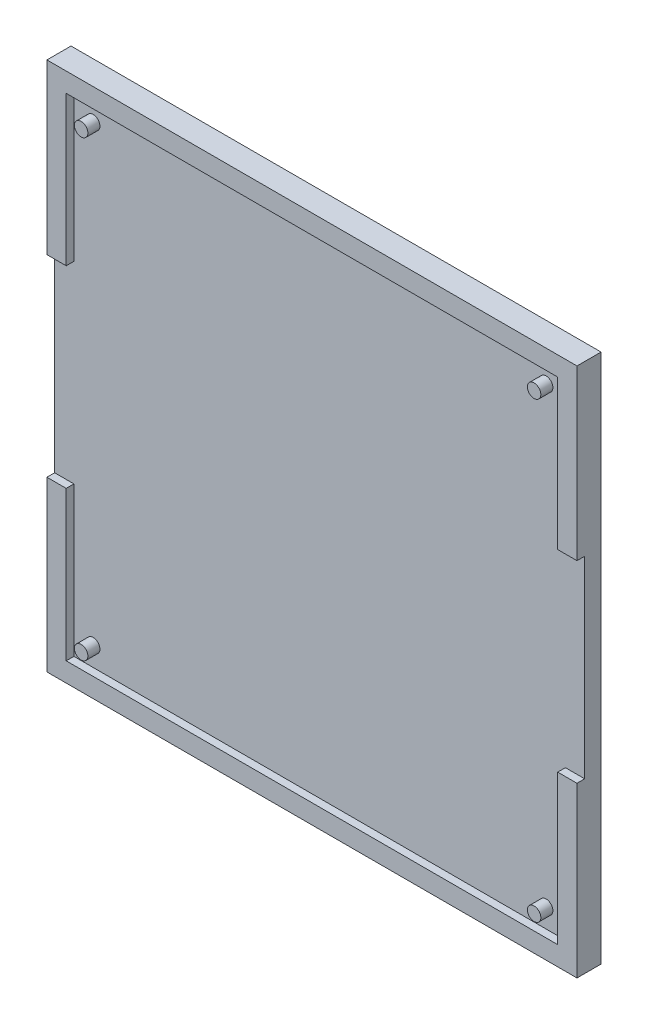
ISO-10303-21;
HEADER;
FILE_DESCRIPTION(('STEP AP214'),'2;1');
FILE_NAME('part.step','',(''),(''),'','','');
FILE_SCHEMA(('AUTOMOTIVE_DESIGN { 1 0 10303 214 1 1 1 1 }'));
ENDSEC;
DATA;
#1=APPLICATION_CONTEXT('core data for automotive mechanical design processes');
#2=APPLICATION_PROTOCOL_DEFINITION('international standard','automotive_design',2000,#1);
#3=PRODUCT_CONTEXT('',#1,'mechanical');
#4=PRODUCT('Part','Part','',(#3));
#5=PRODUCT_RELATED_PRODUCT_CATEGORY('part','',(#4));
#6=PRODUCT_DEFINITION_FORMATION('','',#4);
#7=PRODUCT_DEFINITION_CONTEXT('part definition',#1,'design');
#8=PRODUCT_DEFINITION('design','',#6,#7);
#9=PRODUCT_DEFINITION_SHAPE('','',#8);
#10=(LENGTH_UNIT() NAMED_UNIT(*) SI_UNIT(.MILLI.,.METRE.));
#11=(NAMED_UNIT(*) PLANE_ANGLE_UNIT() SI_UNIT($,.RADIAN.));
#12=(NAMED_UNIT(*) SI_UNIT($,.STERADIAN.) SOLID_ANGLE_UNIT());
#13=UNCERTAINTY_MEASURE_WITH_UNIT(LENGTH_MEASURE(1.E-05),#10,'distance_accuracy_value','');
#14=(GEOMETRIC_REPRESENTATION_CONTEXT(3) GLOBAL_UNCERTAINTY_ASSIGNED_CONTEXT((#13)) GLOBAL_UNIT_ASSIGNED_CONTEXT((#10,
#11,#12)) REPRESENTATION_CONTEXT('',''));
#15=CARTESIAN_POINT('',(0.,0.,0.));
#16=DIRECTION('',(0.,0.,1.));
#17=DIRECTION('',(1.,0.,0.));
#18=AXIS2_PLACEMENT_3D('',#15,#16,#17);
#19=CARTESIAN_POINT('',(0.,0.,5.));
#20=DIRECTION('',(0.,0.,1.));
#21=DIRECTION('',(1.,0.,0.));
#22=AXIS2_PLACEMENT_3D('',#19,#20,#21);
#23=PLANE('',#22);
#24=DIRECTION('',(-1.,0.,0.));
#25=VECTOR('',#24,1.);
#26=CARTESIAN_POINT('',(106.,-35.,5.));
#27=LINE('',#26,#25);
#28=CARTESIAN_POINT('',(110.,-35.,5.));
#29=VERTEX_POINT('',#28);
#30=CARTESIAN_POINT('',(106.,-35.,5.));
#31=VERTEX_POINT('',#30);
#32=EDGE_CURVE('E159',#29,#31,#27,.T.);
#33=ORIENTED_EDGE('',*,*,#32,.F.);
#34=DIRECTION('',(0.,-1.,0.));
#35=VECTOR('',#34,1.);
#36=CARTESIAN_POINT('',(110.,0.,5.));
#37=LINE('',#36,#35);
#38=CARTESIAN_POINT('',(110.,0.,5.));
#39=VERTEX_POINT('',#38);
#40=EDGE_CURVE('E218',#39,#29,#37,.T.);
#41=ORIENTED_EDGE('',*,*,#40,.F.);
#42=DIRECTION('',(1.,0.,0.));
#43=VECTOR('',#42,1.);
#44=CARTESIAN_POINT('',(0.,0.,5.));
#45=LINE('',#44,#43);
#46=CARTESIAN_POINT('',(0.,0.,5.));
#47=VERTEX_POINT('',#46);
#48=EDGE_CURVE('E213',#47,#39,#45,.T.);
#49=ORIENTED_EDGE('',*,*,#48,.F.);
#50=DIRECTION('',(0.,1.,0.));
#51=VECTOR('',#50,1.);
#52=CARTESIAN_POINT('',(0.,0.,5.));
#53=LINE('',#52,#51);
#54=CARTESIAN_POINT('',(0.,-35.,5.));
#55=VERTEX_POINT('',#54);
#56=EDGE_CURVE('E214',#55,#47,#53,.T.);
#57=ORIENTED_EDGE('',*,*,#56,.F.);
#58=DIRECTION('',(-1.,0.,0.));
#59=VECTOR('',#58,1.);
#60=CARTESIAN_POINT('',(3.99999999999996,-35.,5.));
#61=LINE('',#60,#59);
#62=CARTESIAN_POINT('',(3.99999999999996,-35.,5.));
#63=VERTEX_POINT('',#62);
#64=EDGE_CURVE('E263',#63,#55,#61,.T.);
#65=ORIENTED_EDGE('',*,*,#64,.F.);
#66=DIRECTION('',(0.,-1.,0.));
#67=VECTOR('',#66,1.);
#68=CARTESIAN_POINT('',(3.99999999999998,-106.,4.99999999999999));
#69=LINE('',#68,#67);
#70=CARTESIAN_POINT('',(3.99999999999996,-4.,5.));
#71=VERTEX_POINT('',#70);
#72=EDGE_CURVE('E195',#71,#63,#69,.T.);
#73=ORIENTED_EDGE('',*,*,#72,.F.);
#74=DIRECTION('',(-1.,0.,0.));
#75=VECTOR('',#74,1.);
#76=CARTESIAN_POINT('',(106.,-4.,5.));
#77=LINE('',#76,#75);
#78=CARTESIAN_POINT('',(106.,-4.,5.));
#79=VERTEX_POINT('',#78);
#80=EDGE_CURVE('E190',#79,#71,#77,.T.);
#81=ORIENTED_EDGE('',*,*,#80,.F.);
#82=DIRECTION('',(0.,1.,0.));
#83=VECTOR('',#82,1.);
#84=CARTESIAN_POINT('',(106.,-106.,4.99999999999999));
#85=LINE('',#84,#83);
#86=EDGE_CURVE('E191',#31,#79,#85,.T.);
#87=ORIENTED_EDGE('',*,*,#86,.F.);
#88=EDGE_LOOP('',(#33,#41,#49,#57,#65,#73,#81,#87));
#89=FACE_BOUND('',#88,.T.);
#90=ADVANCED_FACE('F33',(#89),#23,.T.);
#91=CARTESIAN_POINT('',(106.,-106.,3.39999999999999));
#92=DIRECTION('',(1.,0.,0.));
#93=DIRECTION('',(0.,1.,0.));
#94=AXIS2_PLACEMENT_3D('',#91,#92,#93);
#95=PLANE('',#94);
#96=DIRECTION('',(0.,1.,0.));
#97=VECTOR('',#96,1.);
#98=CARTESIAN_POINT('',(106.,-106.,3.39999999999999));
#99=LINE('',#98,#97);
#100=CARTESIAN_POINT('',(106.,-35.,3.4));
#101=VERTEX_POINT('',#100);
#102=CARTESIAN_POINT('',(106.,-4.,3.4));
#103=VERTEX_POINT('',#102);
#104=EDGE_CURVE('E174',#101,#103,#99,.T.);
#105=ORIENTED_EDGE('',*,*,#104,.F.);
#106=DIRECTION('',(0.,0.,1.));
#107=VECTOR('',#106,1.);
#108=CARTESIAN_POINT('',(106.,-35.,3.4));
#109=LINE('',#108,#107);
#110=EDGE_CURVE('E58',#101,#31,#109,.T.);
#111=ORIENTED_EDGE('',*,*,#110,.T.);
#112=ORIENTED_EDGE('',*,*,#86,.T.);
#113=DIRECTION('',(0.,0.,1.));
#114=VECTOR('',#113,1.);
#115=CARTESIAN_POINT('',(106.,-4.,3.4));
#116=LINE('',#115,#114);
#117=EDGE_CURVE('E188',#103,#79,#116,.T.);
#118=ORIENTED_EDGE('',*,*,#117,.F.);
#119=EDGE_LOOP('',(#105,#111,#112,#118));
#120=FACE_BOUND('',#119,.T.);
#121=ADVANCED_FACE('F330',(#120),#95,.F.);
#122=CARTESIAN_POINT('',(3.99999999999998,-106.,3.39999999999999));
#123=DIRECTION('',(-1.,0.,0.));
#124=DIRECTION('',(0.,-1.,0.));
#125=AXIS2_PLACEMENT_3D('',#122,#123,#124);
#126=PLANE('',#125);
#127=DIRECTION('',(0.,-1.,0.));
#128=VECTOR('',#127,1.);
#129=CARTESIAN_POINT('',(3.99999999999998,-106.,3.39999999999999));
#130=LINE('',#129,#128);
#131=CARTESIAN_POINT('',(3.99999999999997,-75.,3.4));
#132=VERTEX_POINT('',#131);
#133=CARTESIAN_POINT('',(3.99999999999998,-106.,3.39999999999999));
#134=VERTEX_POINT('',#133);
#135=EDGE_CURVE('E177',#132,#134,#130,.T.);
#136=ORIENTED_EDGE('',*,*,#135,.F.);
#137=DIRECTION('',(0.,0.,1.));
#138=VECTOR('',#137,1.);
#139=CARTESIAN_POINT('',(3.99999999999996,-75.,3.4));
#140=LINE('',#139,#138);
#141=CARTESIAN_POINT('',(3.99999999999996,-75.,5.));
#142=VERTEX_POINT('',#141);
#143=EDGE_CURVE('E50',#132,#142,#140,.T.);
#144=ORIENTED_EDGE('',*,*,#143,.T.);
#145=CARTESIAN_POINT('',(3.99999999999998,-106.,4.99999999999999));
#146=VERTEX_POINT('',#145);
#147=EDGE_CURVE('E194',#142,#146,#69,.T.);
#148=ORIENTED_EDGE('',*,*,#147,.T.);
#149=DIRECTION('',(0.,0.,1.));
#150=VECTOR('',#149,1.);
#151=CARTESIAN_POINT('',(3.99999999999998,-106.,3.39999999999999));
#152=LINE('',#151,#150);
#153=EDGE_CURVE('E203',#134,#146,#152,.T.);
#154=ORIENTED_EDGE('',*,*,#153,.F.);
#155=EDGE_LOOP('',(#136,#144,#148,#154));
#156=FACE_BOUND('',#155,.T.);
#157=ADVANCED_FACE('F336',(#156),#126,.F.);
#158=CARTESIAN_POINT('',(0.,0.,5.));
#159=DIRECTION('',(-1.,0.,0.));
#160=DIRECTION('',(0.,-1.,0.));
#161=AXIS2_PLACEMENT_3D('',#158,#159,#160);
#162=PLANE('',#161);
#163=DIRECTION('',(0.,0.,1.));
#164=VECTOR('',#163,1.);
#165=CARTESIAN_POINT('',(0.,-75.,5.));
#166=LINE('',#165,#164);
#167=CARTESIAN_POINT('',(0.,-75.,3.4));
#168=VERTEX_POINT('',#167);
#169=CARTESIAN_POINT('',(0.,-75.,5.));
#170=VERTEX_POINT('',#169);
#171=EDGE_CURVE('E279',#168,#170,#166,.T.);
#172=ORIENTED_EDGE('',*,*,#171,.F.);
#173=DIRECTION('',(0.,-1.,0.));
#174=VECTOR('',#173,1.);
#175=CARTESIAN_POINT('',(0.,0.,3.4));
#176=LINE('',#175,#174);
#177=CARTESIAN_POINT('',(0.,-35.,3.4));
#178=VERTEX_POINT('',#177);
#179=EDGE_CURVE('E275',#178,#168,#176,.T.);
#180=ORIENTED_EDGE('',*,*,#179,.F.);
#181=DIRECTION('',(0.,0.,-1.));
#182=VECTOR('',#181,1.);
#183=CARTESIAN_POINT('',(0.,-35.,5.));
#184=LINE('',#183,#182);
#185=EDGE_CURVE('E277',#55,#178,#184,.T.);
#186=ORIENTED_EDGE('',*,*,#185,.F.);
#187=ORIENTED_EDGE('',*,*,#56,.T.);
#188=DIRECTION('',(0.,0.,-1.));
#189=VECTOR('',#188,1.);
#190=CARTESIAN_POINT('',(0.,0.,5.));
#191=LINE('',#190,#189);
#192=CARTESIAN_POINT('',(0.,0.,0.));
#193=VERTEX_POINT('',#192);
#194=EDGE_CURVE('E37',#47,#193,#191,.T.);
#195=ORIENTED_EDGE('',*,*,#194,.T.);
#196=DIRECTION('',(0.,1.,0.));
#197=VECTOR('',#196,1.);
#198=CARTESIAN_POINT('',(0.,0.,0.));
#199=LINE('',#198,#197);
#200=CARTESIAN_POINT('',(0.,-110.,0.));
#201=VERTEX_POINT('',#200);
#202=EDGE_CURVE('E202',#201,#193,#199,.T.);
#203=ORIENTED_EDGE('',*,*,#202,.F.);
#204=DIRECTION('',(0.,0.,-1.));
#205=VECTOR('',#204,1.);
#206=CARTESIAN_POINT('',(0.,-110.,5.));
#207=LINE('',#206,#205);
#208=CARTESIAN_POINT('',(0.,-110.,5.));
#209=VERTEX_POINT('',#208);
#210=EDGE_CURVE('E11',#209,#201,#207,.T.);
#211=ORIENTED_EDGE('',*,*,#210,.F.);
#212=EDGE_CURVE('E210',#209,#170,#53,.T.);
#213=ORIENTED_EDGE('',*,*,#212,.T.);
#214=EDGE_LOOP('',(#172,#180,#186,#187,#195,#203,#211,#213));
#215=FACE_BOUND('',#214,.T.);
#216=ADVANCED_FACE('F35',(#215),#162,.T.);
#217=CARTESIAN_POINT('',(0.,-110.,5.));
#218=DIRECTION('',(0.,-1.,0.));
#219=DIRECTION('',(0.,0.,-1.));
#220=AXIS2_PLACEMENT_3D('',#217,#218,#219);
#221=PLANE('',#220);
#222=DIRECTION('',(-1.,0.,0.));
#223=VECTOR('',#222,1.);
#224=CARTESIAN_POINT('',(0.,-110.,0.));
#225=LINE('',#224,#223);
#226=CARTESIAN_POINT('',(110.,-110.,0.));
#227=VERTEX_POINT('',#226);
#228=EDGE_CURVE('E232',#227,#201,#225,.T.);
#229=ORIENTED_EDGE('',*,*,#228,.F.);
#230=DIRECTION('',(0.,0.,-1.));
#231=VECTOR('',#230,1.);
#232=CARTESIAN_POINT('',(110.,-110.,5.));
#233=LINE('',#232,#231);
#234=CARTESIAN_POINT('',(110.,-110.,5.));
#235=VERTEX_POINT('',#234);
#236=EDGE_CURVE('E42',#235,#227,#233,.T.);
#237=ORIENTED_EDGE('',*,*,#236,.F.);
#238=DIRECTION('',(-1.,0.,0.));
#239=VECTOR('',#238,1.);
#240=CARTESIAN_POINT('',(0.,-110.,5.));
#241=LINE('',#240,#239);
#242=EDGE_CURVE('E221',#235,#209,#241,.T.);
#243=ORIENTED_EDGE('',*,*,#242,.T.);
#244=ORIENTED_EDGE('',*,*,#210,.T.);
#245=EDGE_LOOP('',(#229,#237,#243,#244));
#246=FACE_BOUND('',#245,.T.);
#247=ADVANCED_FACE('F252',(#246),#221,.T.);
#248=CARTESIAN_POINT('',(110.,0.,5.));
#249=DIRECTION('',(1.,0.,0.));
#250=DIRECTION('',(0.,0.,-1.));
#251=AXIS2_PLACEMENT_3D('',#248,#249,#250);
#252=PLANE('',#251);
#253=DIRECTION('',(0.,0.,1.));
#254=VECTOR('',#253,1.);
#255=CARTESIAN_POINT('',(110.,-35.,5.));
#256=LINE('',#255,#254);
#257=CARTESIAN_POINT('',(110.,-35.,3.4));
#258=VERTEX_POINT('',#257);
#259=EDGE_CURVE('E284',#258,#29,#256,.T.);
#260=ORIENTED_EDGE('',*,*,#259,.F.);
#261=DIRECTION('',(0.,1.,0.));
#262=VECTOR('',#261,1.);
#263=CARTESIAN_POINT('',(110.,0.,3.4));
#264=LINE('',#263,#262);
#265=CARTESIAN_POINT('',(110.,-75.,3.4));
#266=VERTEX_POINT('',#265);
#267=EDGE_CURVE('E281',#266,#258,#264,.T.);
#268=ORIENTED_EDGE('',*,*,#267,.F.);
#269=DIRECTION('',(0.,0.,-1.));
#270=VECTOR('',#269,1.);
#271=CARTESIAN_POINT('',(110.,-75.,5.));
#272=LINE('',#271,#270);
#273=CARTESIAN_POINT('',(110.,-75.,5.));
#274=VERTEX_POINT('',#273);
#275=EDGE_CURVE('E154',#274,#266,#272,.T.);
#276=ORIENTED_EDGE('',*,*,#275,.F.);
#277=EDGE_CURVE('E217',#274,#235,#37,.T.);
#278=ORIENTED_EDGE('',*,*,#277,.T.);
#279=ORIENTED_EDGE('',*,*,#236,.T.);
#280=DIRECTION('',(0.,-1.,0.));
#281=VECTOR('',#280,1.);
#282=CARTESIAN_POINT('',(110.,0.,0.));
#283=LINE('',#282,#281);
#284=CARTESIAN_POINT('',(110.,0.,0.));
#285=VERTEX_POINT('',#284);
#286=EDGE_CURVE('E229',#285,#227,#283,.T.);
#287=ORIENTED_EDGE('',*,*,#286,.F.);
#288=DIRECTION('',(0.,0.,-1.));
#289=VECTOR('',#288,1.);
#290=CARTESIAN_POINT('',(110.,0.,5.));
#291=LINE('',#290,#289);
#292=EDGE_CURVE('E235',#39,#285,#291,.T.);
#293=ORIENTED_EDGE('',*,*,#292,.F.);
#294=ORIENTED_EDGE('',*,*,#40,.T.);
#295=EDGE_LOOP('',(#260,#268,#276,#278,#279,#287,#293,#294));
#296=FACE_BOUND('',#295,.T.);
#297=ADVANCED_FACE('F346',(#296),#252,.T.);
#298=CARTESIAN_POINT('',(0.,0.,5.));
#299=DIRECTION('',(0.,1.,0.));
#300=DIRECTION('',(0.,0.,1.));
#301=AXIS2_PLACEMENT_3D('',#298,#299,#300);
#302=PLANE('',#301);
#303=DIRECTION('',(1.,0.,0.));
#304=VECTOR('',#303,1.);
#305=CARTESIAN_POINT('',(0.,0.,0.));
#306=LINE('',#305,#304);
#307=EDGE_CURVE('E226',#193,#285,#306,.T.);
#308=ORIENTED_EDGE('',*,*,#307,.F.);
#309=ORIENTED_EDGE('',*,*,#194,.F.);
#310=ORIENTED_EDGE('',*,*,#48,.T.);
#311=ORIENTED_EDGE('',*,*,#292,.T.);
#312=EDGE_LOOP('',(#308,#309,#310,#311));
#313=FACE_BOUND('',#312,.T.);
#314=ADVANCED_FACE('F246',(#313),#302,.T.);
#315=DIRECTION('',(1.,0.,0.));
#316=VECTOR('',#315,1.);
#317=CARTESIAN_POINT('',(106.,-75.,5.));
#318=LINE('',#317,#316);
#319=CARTESIAN_POINT('',(106.,-75.,5.));
#320=VERTEX_POINT('',#319);
#321=EDGE_CURVE('E272',#320,#274,#318,.T.);
#322=ORIENTED_EDGE('',*,*,#321,.F.);
#323=CARTESIAN_POINT('',(106.,-106.,4.99999999999999));
#324=VERTEX_POINT('',#323);
#325=EDGE_CURVE('E168',#324,#320,#85,.T.);
#326=ORIENTED_EDGE('',*,*,#325,.F.);
#327=DIRECTION('',(1.,0.,0.));
#328=VECTOR('',#327,1.);
#329=CARTESIAN_POINT('',(106.,-106.,4.99999999999999));
#330=LINE('',#329,#328);
#331=EDGE_CURVE('E179',#146,#324,#330,.T.);
#332=ORIENTED_EDGE('',*,*,#331,.F.);
#333=ORIENTED_EDGE('',*,*,#147,.F.);
#334=DIRECTION('',(1.,0.,0.));
#335=VECTOR('',#334,1.);
#336=CARTESIAN_POINT('',(3.99999999999996,-75.,5.));
#337=LINE('',#336,#335);
#338=EDGE_CURVE('E260',#170,#142,#337,.T.);
#339=ORIENTED_EDGE('',*,*,#338,.F.);
#340=ORIENTED_EDGE('',*,*,#212,.F.);
#341=ORIENTED_EDGE('',*,*,#242,.F.);
#342=ORIENTED_EDGE('',*,*,#277,.F.);
#343=EDGE_LOOP('',(#322,#326,#332,#333,#339,#340,#341,#342));
#344=FACE_BOUND('',#343,.T.);
#345=ADVANCED_FACE('F257',(#344),#23,.T.);
#346=CARTESIAN_POINT('',(0.,0.,0.));
#347=DIRECTION('',(0.,0.,1.));
#348=DIRECTION('',(1.,0.,0.));
#349=AXIS2_PLACEMENT_3D('',#346,#347,#348);
#350=PLANE('',#349);
#351=ORIENTED_EDGE('',*,*,#202,.T.);
#352=ORIENTED_EDGE('',*,*,#307,.T.);
#353=ORIENTED_EDGE('',*,*,#286,.T.);
#354=ORIENTED_EDGE('',*,*,#228,.T.);
#355=EDGE_LOOP('',(#351,#352,#353,#354));
#356=FACE_BOUND('',#355,.T.);
#357=ADVANCED_FACE('F248',(#356),#350,.F.);
#358=ORIENTED_EDGE('',*,*,#325,.T.);
#359=DIRECTION('',(0.,0.,1.));
#360=VECTOR('',#359,1.);
#361=CARTESIAN_POINT('',(106.,-75.,3.4));
#362=LINE('',#361,#360);
#363=CARTESIAN_POINT('',(106.,-75.,3.4));
#364=VERTEX_POINT('',#363);
#365=EDGE_CURVE('E151',#364,#320,#362,.T.);
#366=ORIENTED_EDGE('',*,*,#365,.F.);
#367=CARTESIAN_POINT('',(106.,-106.,3.39999999999999));
#368=VERTEX_POINT('',#367);
#369=EDGE_CURVE('E165',#368,#364,#99,.T.);
#370=ORIENTED_EDGE('',*,*,#369,.F.);
#371=DIRECTION('',(0.,0.,1.));
#372=VECTOR('',#371,1.);
#373=CARTESIAN_POINT('',(106.,-106.,3.39999999999999));
#374=LINE('',#373,#372);
#375=EDGE_CURVE('E200',#368,#324,#374,.T.);
#376=ORIENTED_EDGE('',*,*,#375,.T.);
#377=EDGE_LOOP('',(#358,#366,#370,#376));
#378=FACE_BOUND('',#377,.T.);
#379=ADVANCED_FACE('F164',(#378),#95,.F.);
#380=CARTESIAN_POINT('',(106.,-106.,3.39999999999999));
#381=DIRECTION('',(0.,-1.,0.));
#382=DIRECTION('',(1.,0.,0.));
#383=AXIS2_PLACEMENT_3D('',#380,#381,#382);
#384=PLANE('',#383);
#385=ORIENTED_EDGE('',*,*,#331,.T.);
#386=ORIENTED_EDGE('',*,*,#375,.F.);
#387=DIRECTION('',(1.,0.,0.));
#388=VECTOR('',#387,1.);
#389=CARTESIAN_POINT('',(106.,-106.,3.39999999999999));
#390=LINE('',#389,#388);
#391=EDGE_CURVE('E172',#134,#368,#390,.T.);
#392=ORIENTED_EDGE('',*,*,#391,.F.);
#393=ORIENTED_EDGE('',*,*,#153,.T.);
#394=EDGE_LOOP('',(#385,#386,#392,#393));
#395=FACE_BOUND('',#394,.T.);
#396=ADVANCED_FACE('F366',(#395),#384,.F.);
#397=ORIENTED_EDGE('',*,*,#72,.T.);
#398=DIRECTION('',(0.,0.,1.));
#399=VECTOR('',#398,1.);
#400=CARTESIAN_POINT('',(3.99999999999996,-35.,3.4));
#401=LINE('',#400,#399);
#402=CARTESIAN_POINT('',(3.99999999999996,-35.,3.4));
#403=VERTEX_POINT('',#402);
#404=EDGE_CURVE('E273',#403,#63,#401,.T.);
#405=ORIENTED_EDGE('',*,*,#404,.F.);
#406=CARTESIAN_POINT('',(3.99999999999996,-4.,3.4));
#407=VERTEX_POINT('',#406);
#408=EDGE_CURVE('E184',#407,#403,#130,.T.);
#409=ORIENTED_EDGE('',*,*,#408,.F.);
#410=DIRECTION('',(0.,0.,1.));
#411=VECTOR('',#410,1.);
#412=CARTESIAN_POINT('',(3.99999999999996,-4.,3.4));
#413=LINE('',#412,#411);
#414=EDGE_CURVE('E206',#407,#71,#413,.T.);
#415=ORIENTED_EDGE('',*,*,#414,.T.);
#416=EDGE_LOOP('',(#397,#405,#409,#415));
#417=FACE_BOUND('',#416,.T.);
#418=ADVANCED_FACE('F323',(#417),#126,.F.);
#419=CARTESIAN_POINT('',(106.,-4.,3.4));
#420=DIRECTION('',(0.,1.,0.));
#421=DIRECTION('',(0.,0.,1.));
#422=AXIS2_PLACEMENT_3D('',#419,#420,#421);
#423=PLANE('',#422);
#424=ORIENTED_EDGE('',*,*,#80,.T.);
#425=ORIENTED_EDGE('',*,*,#414,.F.);
#426=DIRECTION('',(-1.,0.,0.));
#427=VECTOR('',#426,1.);
#428=CARTESIAN_POINT('',(106.,-4.,3.4));
#429=LINE('',#428,#427);
#430=EDGE_CURVE('E173',#103,#407,#429,.T.);
#431=ORIENTED_EDGE('',*,*,#430,.F.);
#432=ORIENTED_EDGE('',*,*,#117,.T.);
#433=EDGE_LOOP('',(#424,#425,#431,#432));
#434=FACE_BOUND('',#433,.T.);
#435=ADVANCED_FACE('F313',(#434),#423,.F.);
#436=CARTESIAN_POINT('',(0.,0.,3.4));
#437=DIRECTION('',(0.,0.,1.));
#438=DIRECTION('',(0.,-1.,0.));
#439=AXIS2_PLACEMENT_3D('',#436,#437,#438);
#440=PLANE('',#439);
#441=CARTESIAN_POINT('',(7.99999999999998,-8.00000000000001,3.4));
#442=DIRECTION('',(0.,0.,1.));
#443=DIRECTION('',(0.,-1.,0.));
#444=AXIS2_PLACEMENT_3D('',#441,#442,#443);
#445=CIRCLE('',#444,1.4);
#446=CARTESIAN_POINT('',(7.99999999999998,-9.40000000000002,3.4));
#447=VERTEX_POINT('',#446);
#448=EDGE_CURVE('E286',#447,#447,#445,.T.);
#449=ORIENTED_EDGE('',*,*,#448,.F.);
#450=EDGE_LOOP('',(#449));
#451=FACE_BOUND('',#450,.T.);
#452=CARTESIAN_POINT('',(102.,-8.00000000000001,3.4));
#453=DIRECTION('',(0.,0.,1.));
#454=DIRECTION('',(0.,-1.,0.));
#455=AXIS2_PLACEMENT_3D('',#452,#453,#454);
#456=CIRCLE('',#455,1.4);
#457=CARTESIAN_POINT('',(102.,-9.40000000000001,3.4));
#458=VERTEX_POINT('',#457);
#459=EDGE_CURVE('E290',#458,#458,#456,.T.);
#460=ORIENTED_EDGE('',*,*,#459,.F.);
#461=EDGE_LOOP('',(#460));
#462=FACE_BOUND('',#461,.T.);
#463=CARTESIAN_POINT('',(7.99999999999997,-102.,3.39999999999999));
#464=DIRECTION('',(0.,0.,1.));
#465=DIRECTION('',(0.,-1.,0.));
#466=AXIS2_PLACEMENT_3D('',#463,#464,#465);
#467=CIRCLE('',#466,1.4);
#468=CARTESIAN_POINT('',(7.99999999999997,-103.4,3.39999999999999));
#469=VERTEX_POINT('',#468);
#470=EDGE_CURVE('E296',#469,#469,#467,.T.);
#471=ORIENTED_EDGE('',*,*,#470,.F.);
#472=EDGE_LOOP('',(#471));
#473=FACE_BOUND('',#472,.T.);
#474=CARTESIAN_POINT('',(102.,-102.,3.39999999999999));
#475=DIRECTION('',(0.,0.,1.));
#476=DIRECTION('',(0.,-1.,0.));
#477=AXIS2_PLACEMENT_3D('',#474,#475,#476);
#478=CIRCLE('',#477,1.4);
#479=CARTESIAN_POINT('',(102.,-103.4,3.39999999999999));
#480=VERTEX_POINT('',#479);
#481=EDGE_CURVE('E181',#480,#480,#478,.T.);
#482=ORIENTED_EDGE('',*,*,#481,.F.);
#483=EDGE_LOOP('',(#482));
#484=FACE_BOUND('',#483,.T.);
#485=ORIENTED_EDGE('',*,*,#369,.T.);
#486=DIRECTION('',(1.,0.,0.));
#487=VECTOR('',#486,1.);
#488=CARTESIAN_POINT('',(106.,-75.,3.4));
#489=LINE('',#488,#487);
#490=EDGE_CURVE('E148',#364,#266,#489,.T.);
#491=ORIENTED_EDGE('',*,*,#490,.T.);
#492=ORIENTED_EDGE('',*,*,#267,.T.);
#493=DIRECTION('',(-1.,0.,0.));
#494=VECTOR('',#493,1.);
#495=CARTESIAN_POINT('',(106.,-35.,3.4));
#496=LINE('',#495,#494);
#497=EDGE_CURVE('E158',#258,#101,#496,.T.);
#498=ORIENTED_EDGE('',*,*,#497,.T.);
#499=ORIENTED_EDGE('',*,*,#104,.T.);
#500=ORIENTED_EDGE('',*,*,#430,.T.);
#501=ORIENTED_EDGE('',*,*,#408,.T.);
#502=DIRECTION('',(-1.,0.,0.));
#503=VECTOR('',#502,1.);
#504=CARTESIAN_POINT('',(3.99999999999996,-35.,3.4));
#505=LINE('',#504,#503);
#506=EDGE_CURVE('E262',#403,#178,#505,.T.);
#507=ORIENTED_EDGE('',*,*,#506,.T.);
#508=ORIENTED_EDGE('',*,*,#179,.T.);
#509=DIRECTION('',(1.,0.,0.));
#510=VECTOR('',#509,1.);
#511=CARTESIAN_POINT('',(3.99999999999996,-75.,3.4));
#512=LINE('',#511,#510);
#513=EDGE_CURVE('E266',#168,#132,#512,.T.);
#514=ORIENTED_EDGE('',*,*,#513,.T.);
#515=ORIENTED_EDGE('',*,*,#135,.T.);
#516=ORIENTED_EDGE('',*,*,#391,.T.);
#517=EDGE_LOOP('',(#485,#491,#492,#498,#499,#500,#501,#507,#508,#514,#515,#516));
#518=FACE_BOUND('',#517,.T.);
#519=ADVANCED_FACE('F170',(#451,#462,#473,#484,#518),#440,.T.);
#520=CARTESIAN_POINT('',(102.,-102.,5.89999999999999));
#521=DIRECTION('',(0.,0.,-1.));
#522=DIRECTION('',(0.,1.,0.));
#523=AXIS2_PLACEMENT_3D('',#520,#521,#522);
#524=CYLINDRICAL_SURFACE('',#523,1.4);
#525=CARTESIAN_POINT('',(102.,-102.,5.89999999999999));
#526=DIRECTION('',(0.,0.,1.));
#527=DIRECTION('',(0.,-1.,0.));
#528=AXIS2_PLACEMENT_3D('',#525,#526,#527);
#529=CIRCLE('',#528,1.4);
#530=CARTESIAN_POINT('',(102.,-103.4,5.89999999999999));
#531=VERTEX_POINT('',#530);
#532=EDGE_CURVE('E303',#531,#531,#529,.T.);
#533=ORIENTED_EDGE('',*,*,#532,.F.);
#534=EDGE_LOOP('',(#533));
#535=FACE_BOUND('',#534,.T.);
#536=ORIENTED_EDGE('',*,*,#481,.T.);
#537=EDGE_LOOP('',(#536));
#538=FACE_BOUND('',#537,.T.);
#539=ADVANCED_FACE('F310',(#535,#538),#524,.T.);
#540=CARTESIAN_POINT('',(102.,-102.,5.89999999999999));
#541=DIRECTION('',(0.,0.,1.));
#542=DIRECTION('',(0.,-1.,0.));
#543=AXIS2_PLACEMENT_3D('',#540,#541,#542);
#544=PLANE('',#543);
#545=ORIENTED_EDGE('',*,*,#532,.T.);
#546=EDGE_LOOP('',(#545));
#547=FACE_BOUND('',#546,.T.);
#548=ADVANCED_FACE('F320',(#547),#544,.T.);
#549=CARTESIAN_POINT('',(7.99999999999997,-102.,5.89999999999999));
#550=DIRECTION('',(0.,0.,-1.));
#551=DIRECTION('',(0.,1.,0.));
#552=AXIS2_PLACEMENT_3D('',#549,#550,#551);
#553=CYLINDRICAL_SURFACE('',#552,1.4);
#554=CARTESIAN_POINT('',(7.99999999999997,-102.,5.89999999999999));
#555=DIRECTION('',(0.,0.,1.));
#556=DIRECTION('',(0.,-1.,0.));
#557=AXIS2_PLACEMENT_3D('',#554,#555,#556);
#558=CIRCLE('',#557,1.4);
#559=CARTESIAN_POINT('',(7.99999999999997,-103.4,5.89999999999999));
#560=VERTEX_POINT('',#559);
#561=EDGE_CURVE('E299',#560,#560,#558,.T.);
#562=ORIENTED_EDGE('',*,*,#561,.F.);
#563=EDGE_LOOP('',(#562));
#564=FACE_BOUND('',#563,.T.);
#565=ORIENTED_EDGE('',*,*,#470,.T.);
#566=EDGE_LOOP('',(#565));
#567=FACE_BOUND('',#566,.T.);
#568=ADVANCED_FACE('F423',(#564,#567),#553,.T.);
#569=CARTESIAN_POINT('',(7.99999999999997,-102.,5.89999999999999));
#570=DIRECTION('',(0.,0.,1.));
#571=DIRECTION('',(0.,-1.,0.));
#572=AXIS2_PLACEMENT_3D('',#569,#570,#571);
#573=PLANE('',#572);
#574=ORIENTED_EDGE('',*,*,#561,.T.);
#575=EDGE_LOOP('',(#574));
#576=FACE_BOUND('',#575,.T.);
#577=ADVANCED_FACE('F419',(#576),#573,.T.);
#578=CARTESIAN_POINT('',(102.,-8.00000000000001,5.9));
#579=DIRECTION('',(0.,0.,-1.));
#580=DIRECTION('',(0.,1.,0.));
#581=AXIS2_PLACEMENT_3D('',#578,#579,#580);
#582=CYLINDRICAL_SURFACE('',#581,1.4);
#583=CARTESIAN_POINT('',(102.,-8.00000000000001,5.9));
#584=DIRECTION('',(0.,0.,1.));
#585=DIRECTION('',(0.,-1.,0.));
#586=AXIS2_PLACEMENT_3D('',#583,#584,#585);
#587=CIRCLE('',#586,1.4);
#588=CARTESIAN_POINT('',(102.,-9.40000000000001,5.9));
#589=VERTEX_POINT('',#588);
#590=EDGE_CURVE('E293',#589,#589,#587,.T.);
#591=ORIENTED_EDGE('',*,*,#590,.F.);
#592=EDGE_LOOP('',(#591));
#593=FACE_BOUND('',#592,.T.);
#594=ORIENTED_EDGE('',*,*,#459,.T.);
#595=EDGE_LOOP('',(#594));
#596=FACE_BOUND('',#595,.T.);
#597=ADVANCED_FACE('F415',(#593,#596),#582,.T.);
#598=CARTESIAN_POINT('',(102.,-8.00000000000001,5.9));
#599=DIRECTION('',(0.,0.,1.));
#600=DIRECTION('',(0.,-1.,0.));
#601=AXIS2_PLACEMENT_3D('',#598,#599,#600);
#602=PLANE('',#601);
#603=ORIENTED_EDGE('',*,*,#590,.T.);
#604=EDGE_LOOP('',(#603));
#605=FACE_BOUND('',#604,.T.);
#606=ADVANCED_FACE('F411',(#605),#602,.T.);
#607=CARTESIAN_POINT('',(7.99999999999998,-8.00000000000001,5.9));
#608=DIRECTION('',(0.,0.,-1.));
#609=DIRECTION('',(0.,1.,0.));
#610=AXIS2_PLACEMENT_3D('',#607,#608,#609);
#611=CYLINDRICAL_SURFACE('',#610,1.4);
#612=CARTESIAN_POINT('',(7.99999999999998,-8.00000000000001,5.9));
#613=DIRECTION('',(0.,0.,1.));
#614=DIRECTION('',(0.,-1.,0.));
#615=AXIS2_PLACEMENT_3D('',#612,#613,#614);
#616=CIRCLE('',#615,1.4);
#617=CARTESIAN_POINT('',(7.99999999999998,-9.40000000000002,5.9));
#618=VERTEX_POINT('',#617);
#619=EDGE_CURVE('E287',#618,#618,#616,.T.);
#620=ORIENTED_EDGE('',*,*,#619,.F.);
#621=EDGE_LOOP('',(#620));
#622=FACE_BOUND('',#621,.T.);
#623=ORIENTED_EDGE('',*,*,#448,.T.);
#624=EDGE_LOOP('',(#623));
#625=FACE_BOUND('',#624,.T.);
#626=ADVANCED_FACE('F407',(#622,#625),#611,.T.);
#627=CARTESIAN_POINT('',(7.99999999999998,-8.00000000000001,5.9));
#628=DIRECTION('',(0.,0.,1.));
#629=DIRECTION('',(0.,-1.,0.));
#630=AXIS2_PLACEMENT_3D('',#627,#628,#629);
#631=PLANE('',#630);
#632=ORIENTED_EDGE('',*,*,#619,.T.);
#633=EDGE_LOOP('',(#632));
#634=FACE_BOUND('',#633,.T.);
#635=ADVANCED_FACE('F403',(#634),#631,.T.);
#636=CARTESIAN_POINT('',(3.99999999999996,-75.,3.4));
#637=DIRECTION('',(0.,-1.,0.));
#638=DIRECTION('',(0.,0.,-1.));
#639=AXIS2_PLACEMENT_3D('',#636,#637,#638);
#640=PLANE('',#639);
#641=ORIENTED_EDGE('',*,*,#171,.T.);
#642=ORIENTED_EDGE('',*,*,#338,.T.);
#643=ORIENTED_EDGE('',*,*,#143,.F.);
#644=ORIENTED_EDGE('',*,*,#513,.F.);
#645=EDGE_LOOP('',(#641,#642,#643,#644));
#646=FACE_BOUND('',#645,.T.);
#647=ADVANCED_FACE('F381',(#646),#640,.F.);
#648=CARTESIAN_POINT('',(3.99999999999996,-35.,3.4));
#649=DIRECTION('',(0.,1.,0.));
#650=DIRECTION('',(0.,0.,1.));
#651=AXIS2_PLACEMENT_3D('',#648,#649,#650);
#652=PLANE('',#651);
#653=ORIENTED_EDGE('',*,*,#185,.T.);
#654=ORIENTED_EDGE('',*,*,#506,.F.);
#655=ORIENTED_EDGE('',*,*,#404,.T.);
#656=ORIENTED_EDGE('',*,*,#64,.T.);
#657=EDGE_LOOP('',(#653,#654,#655,#656));
#658=FACE_BOUND('',#657,.T.);
#659=ADVANCED_FACE('F379',(#658),#652,.F.);
#660=CARTESIAN_POINT('',(106.,-35.,3.4));
#661=DIRECTION('',(0.,1.,0.));
#662=DIRECTION('',(-1.,0.,0.));
#663=AXIS2_PLACEMENT_3D('',#660,#661,#662);
#664=PLANE('',#663);
#665=ORIENTED_EDGE('',*,*,#259,.T.);
#666=ORIENTED_EDGE('',*,*,#32,.T.);
#667=ORIENTED_EDGE('',*,*,#110,.F.);
#668=ORIENTED_EDGE('',*,*,#497,.F.);
#669=EDGE_LOOP('',(#665,#666,#667,#668));
#670=FACE_BOUND('',#669,.T.);
#671=ADVANCED_FACE('F392',(#670),#664,.F.);
#672=CARTESIAN_POINT('',(106.,-75.,3.4));
#673=DIRECTION('',(0.,-1.,0.));
#674=DIRECTION('',(0.,0.,-1.));
#675=AXIS2_PLACEMENT_3D('',#672,#673,#674);
#676=PLANE('',#675);
#677=ORIENTED_EDGE('',*,*,#275,.T.);
#678=ORIENTED_EDGE('',*,*,#490,.F.);
#679=ORIENTED_EDGE('',*,*,#365,.T.);
#680=ORIENTED_EDGE('',*,*,#321,.T.);
#681=EDGE_LOOP('',(#677,#678,#679,#680));
#682=FACE_BOUND('',#681,.T.);
#683=ADVANCED_FACE('F150',(#682),#676,.F.);
#684=CLOSED_SHELL('',(#90,#121,#157,#216,#247,#297,#314,#345,#357,#379,#396,#418,#435,#519,#539,
#548,#568,#577,#597,#606,#626,#635,#647,#659,#671,#683));
#685=MANIFOLD_SOLID_BREP('B2',#684);
#686=ADVANCED_BREP_SHAPE_REPRESENTATION('',(#18,#685),#14);
#687=SHAPE_DEFINITION_REPRESENTATION(#9,#686);
ENDSEC;
END-ISO-10303-21;
